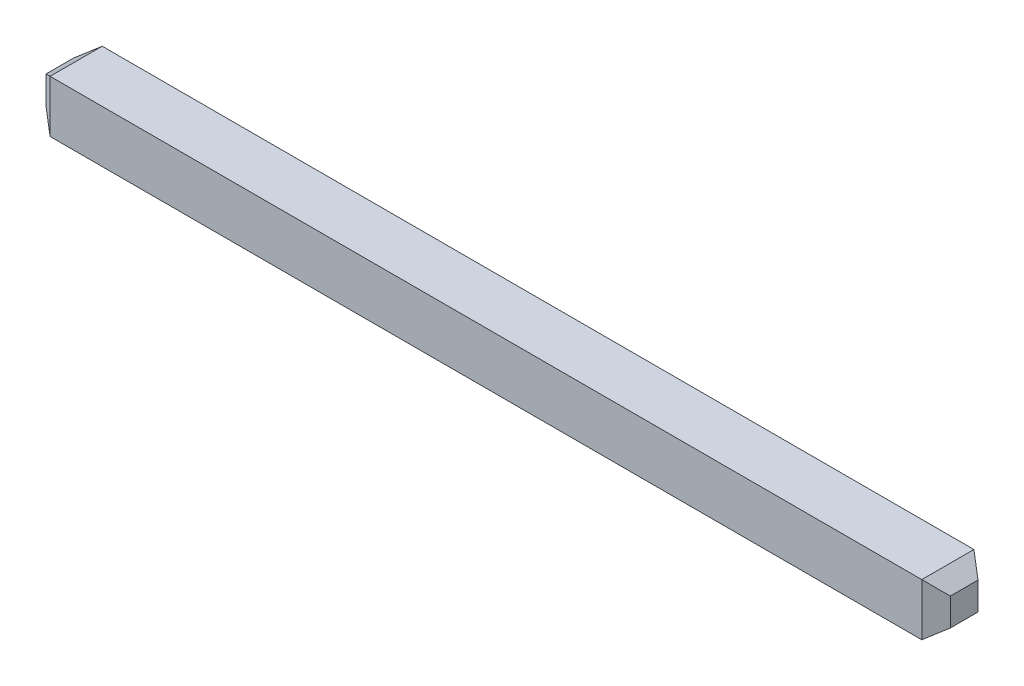
ISO-10303-21;
HEADER;
FILE_DESCRIPTION(('STEP AP214'),'2;1');
FILE_NAME('part.step','',(''),(''),'','','');
FILE_SCHEMA(('AUTOMOTIVE_DESIGN { 1 0 10303 214 1 1 1 1 }'));
ENDSEC;
DATA;
#1=APPLICATION_CONTEXT('core data for automotive mechanical design processes');
#2=APPLICATION_PROTOCOL_DEFINITION('international standard','automotive_design',2000,#1);
#3=PRODUCT_CONTEXT('',#1,'mechanical');
#4=PRODUCT('Part','Part','',(#3));
#5=PRODUCT_RELATED_PRODUCT_CATEGORY('part','',(#4));
#6=PRODUCT_DEFINITION_FORMATION('','',#4);
#7=PRODUCT_DEFINITION_CONTEXT('part definition',#1,'design');
#8=PRODUCT_DEFINITION('design','',#6,#7);
#9=PRODUCT_DEFINITION_SHAPE('','',#8);
#10=(LENGTH_UNIT() NAMED_UNIT(*) SI_UNIT(.MILLI.,.METRE.));
#11=(NAMED_UNIT(*) PLANE_ANGLE_UNIT() SI_UNIT($,.RADIAN.));
#12=(NAMED_UNIT(*) SI_UNIT($,.STERADIAN.) SOLID_ANGLE_UNIT());
#13=UNCERTAINTY_MEASURE_WITH_UNIT(LENGTH_MEASURE(1.E-05),#10,'distance_accuracy_value','');
#14=(GEOMETRIC_REPRESENTATION_CONTEXT(3) GLOBAL_UNCERTAINTY_ASSIGNED_CONTEXT((#13)) GLOBAL_UNIT_ASSIGNED_CONTEXT((#10,
#11,#12)) REPRESENTATION_CONTEXT('',''));
#15=CARTESIAN_POINT('',(0.,0.,0.));
#16=DIRECTION('',(0.,0.,1.));
#17=DIRECTION('',(1.,0.,0.));
#18=AXIS2_PLACEMENT_3D('',#15,#16,#17);
#19=CARTESIAN_POINT('',(-2.4,3.77,-21.835));
#20=DIRECTION('',(0.5999999999908,0.,0.8000000000069));
#21=DIRECTION('',(0.8000000000069,0.,-0.5999999999908));
#22=AXIS2_PLACEMENT_3D('',#19,#20,#21);
#23=PLANE('',#22);
#24=DIRECTION('',(0.,1.,0.));
#25=VECTOR('',#24,1.);
#26=CARTESIAN_POINT('',(-2.3,3.77,-21.91));
#27=LINE('',#26,#25);
#28=CARTESIAN_POINT('',(-2.29999999999957,4.09,-21.9099999999994));
#29=VERTEX_POINT('',#28);
#30=CARTESIAN_POINT('',(-2.29999999999957,3.45,-21.9099999999994));
#31=VERTEX_POINT('',#30);
#32=EDGE_CURVE('E101',#29,#31,#27,.F.);
#33=ORIENTED_EDGE('',*,*,#32,.T.);
#34=DIRECTION('',(-0.685994340570039,0.514495755427529,0.51449575542752));
#35=VECTOR('',#34,1.);
#36=CARTESIAN_POINT('',(-2.3,3.45,-21.91));
#37=LINE('',#36,#35);
#38=CARTESIAN_POINT('',(-2.50000000000022,3.6,-21.7600000000003));
#39=VERTEX_POINT('',#38);
#40=EDGE_CURVE('E85',#31,#39,#37,.T.);
#41=ORIENTED_EDGE('',*,*,#40,.T.);
#42=DIRECTION('',(0.,1.,0.));
#43=VECTOR('',#42,1.);
#44=CARTESIAN_POINT('',(-2.5,3.77,-21.76));
#45=LINE('',#44,#43);
#46=CARTESIAN_POINT('',(-2.50000000000043,3.94,-21.7600000000006));
#47=VERTEX_POINT('',#46);
#48=EDGE_CURVE('E79',#39,#47,#45,.T.);
#49=ORIENTED_EDGE('',*,*,#48,.T.);
#50=DIRECTION('',(-0.685994340570039,-0.514495755427529,0.51449575542752));
#51=VECTOR('',#50,1.);
#52=CARTESIAN_POINT('',(-2.3,4.09,-21.91));
#53=LINE('',#52,#51);
#54=EDGE_CURVE('E20',#29,#47,#53,.T.);
#55=ORIENTED_EDGE('',*,*,#54,.F.);
#56=EDGE_LOOP('',(#33,#41,#49,#55));
#57=FACE_BOUND('',#56,.T.);
#58=ADVANCED_FACE('F17',(#57),#23,.F.);
#59=CARTESIAN_POINT('',(8.5,3.77,-21.835));
#60=DIRECTION('',(-0.5999999999908,0.,0.8000000000069));
#61=DIRECTION('',(0.8000000000069,0.,0.5999999999908));
#62=AXIS2_PLACEMENT_3D('',#59,#60,#61);
#63=PLANE('',#62);
#64=DIRECTION('',(0.,1.,0.));
#65=VECTOR('',#64,1.);
#66=CARTESIAN_POINT('',(8.6,3.77,-21.76));
#67=LINE('',#66,#65);
#68=CARTESIAN_POINT('',(8.60000000000021,3.6,-21.7600000000003));
#69=VERTEX_POINT('',#68);
#70=CARTESIAN_POINT('',(8.60000000000043,3.94,-21.7600000000006));
#71=VERTEX_POINT('',#70);
#72=EDGE_CURVE('E113',#69,#71,#67,.T.);
#73=ORIENTED_EDGE('',*,*,#72,.F.);
#74=DIRECTION('',(-0.685994340570037,-0.514495755427528,-0.514495755427522));
#75=VECTOR('',#74,1.);
#76=CARTESIAN_POINT('',(8.6,3.6,-21.76));
#77=LINE('',#76,#75);
#78=CARTESIAN_POINT('',(8.39999999999957,3.45,-21.9099999999994));
#79=VERTEX_POINT('',#78);
#80=EDGE_CURVE('E108',#69,#79,#77,.T.);
#81=ORIENTED_EDGE('',*,*,#80,.T.);
#82=DIRECTION('',(0.,1.,0.));
#83=VECTOR('',#82,1.);
#84=CARTESIAN_POINT('',(8.4,3.77,-21.91));
#85=LINE('',#84,#83);
#86=CARTESIAN_POINT('',(8.39999999999957,4.09,-21.9099999999994));
#87=VERTEX_POINT('',#86);
#88=EDGE_CURVE('E99',#79,#87,#85,.T.);
#89=ORIENTED_EDGE('',*,*,#88,.T.);
#90=DIRECTION('',(-0.685994340570037,0.514495755427528,-0.514495755427522));
#91=VECTOR('',#90,1.);
#92=CARTESIAN_POINT('',(8.6,3.94,-21.76));
#93=LINE('',#92,#91);
#94=EDGE_CURVE('E116',#71,#87,#93,.T.);
#95=ORIENTED_EDGE('',*,*,#94,.F.);
#96=EDGE_LOOP('',(#73,#81,#89,#95));
#97=FACE_BOUND('',#96,.T.);
#98=ADVANCED_FACE('F214',(#97),#63,.F.);
#99=CARTESIAN_POINT('',(-2.4,4.015,-21.59));
#100=DIRECTION('',(-0.6,0.8,0.));
#101=DIRECTION('',(-0.8,-0.6,0.));
#102=AXIS2_PLACEMENT_3D('',#99,#100,#101);
#103=PLANE('',#102);
#104=DIRECTION('',(-0.685994340575952,-0.514495755427526,-0.514495755419639));
#105=VECTOR('',#104,1.);
#106=CARTESIAN_POINT('',(-2.29999999999914,4.09,-21.2700000000012));
#107=LINE('',#106,#105);
#108=CARTESIAN_POINT('',(-2.29999999999989,4.09,-21.2700000000001));
#109=VERTEX_POINT('',#108);
#110=CARTESIAN_POINT('',(-2.50000000000022,3.94,-21.4199999999997));
#111=VERTEX_POINT('',#110);
#112=EDGE_CURVE('E128',#109,#111,#107,.T.);
#113=ORIENTED_EDGE('',*,*,#112,.F.);
#114=DIRECTION('',(0.,0.,1.));
#115=VECTOR('',#114,1.);
#116=CARTESIAN_POINT('',(-2.3,4.09,-21.59));
#117=LINE('',#116,#115);
#118=EDGE_CURVE('E93',#29,#109,#117,.T.);
#119=ORIENTED_EDGE('',*,*,#118,.F.);
#120=ORIENTED_EDGE('',*,*,#54,.T.);
#121=DIRECTION('',(0.,0.,-1.));
#122=VECTOR('',#121,1.);
#123=CARTESIAN_POINT('',(-2.5,3.94,-21.59));
#124=LINE('',#123,#122);
#125=EDGE_CURVE('E87',#47,#111,#124,.F.);
#126=ORIENTED_EDGE('',*,*,#125,.T.);
#127=EDGE_LOOP('',(#113,#119,#120,#126));
#128=FACE_BOUND('',#127,.T.);
#129=ADVANCED_FACE('F90',(#128),#103,.T.);
#130=CARTESIAN_POINT('',(-2.5,3.77,-21.59));
#131=DIRECTION('',(1.,0.,0.));
#132=DIRECTION('',(0.,0.,-1.));
#133=AXIS2_PLACEMENT_3D('',#130,#131,#132);
#134=PLANE('',#133);
#135=DIRECTION('',(0.,1.,0.));
#136=VECTOR('',#135,1.);
#137=CARTESIAN_POINT('',(-2.50000000000086,3.77,-21.4199999999989));
#138=LINE('',#137,#136);
#139=CARTESIAN_POINT('',(-2.50000000000022,3.6,-21.4199999999997));
#140=VERTEX_POINT('',#139);
#141=EDGE_CURVE('E97',#111,#140,#138,.F.);
#142=ORIENTED_EDGE('',*,*,#141,.F.);
#143=ORIENTED_EDGE('',*,*,#125,.F.);
#144=ORIENTED_EDGE('',*,*,#48,.F.);
#145=DIRECTION('',(0.,0.,1.));
#146=VECTOR('',#145,1.);
#147=CARTESIAN_POINT('',(-2.5,3.6,-21.59));
#148=LINE('',#147,#146);
#149=EDGE_CURVE('E105',#39,#140,#148,.T.);
#150=ORIENTED_EDGE('',*,*,#149,.T.);
#151=EDGE_LOOP('',(#142,#143,#144,#150));
#152=FACE_BOUND('',#151,.T.);
#153=ADVANCED_FACE('F95',(#152),#134,.F.);
#154=CARTESIAN_POINT('',(3.05,3.77,-21.91));
#155=DIRECTION('',(0.,0.,1.));
#156=DIRECTION('',(1.,0.,0.));
#157=AXIS2_PLACEMENT_3D('',#154,#155,#156);
#158=PLANE('',#157);
#159=ORIENTED_EDGE('',*,*,#32,.F.);
#160=DIRECTION('',(1.,0.,0.));
#161=VECTOR('',#160,1.);
#162=CARTESIAN_POINT('',(3.05,4.09,-21.91));
#163=LINE('',#162,#161);
#164=EDGE_CURVE('E122',#87,#29,#163,.F.);
#165=ORIENTED_EDGE('',*,*,#164,.F.);
#166=ORIENTED_EDGE('',*,*,#88,.F.);
#167=DIRECTION('',(1.,0.,0.));
#168=VECTOR('',#167,1.);
#169=CARTESIAN_POINT('',(3.05,3.45,-21.91));
#170=LINE('',#169,#168);
#171=EDGE_CURVE('E136',#79,#31,#170,.F.);
#172=ORIENTED_EDGE('',*,*,#171,.T.);
#173=EDGE_LOOP('',(#159,#165,#166,#172));
#174=FACE_BOUND('',#173,.T.);
#175=ADVANCED_FACE('F182',(#174),#158,.F.);
#176=CARTESIAN_POINT('',(-2.4,3.525,-21.59));
#177=DIRECTION('',(0.6,0.8,0.));
#178=DIRECTION('',(-0.8,0.6,0.));
#179=AXIS2_PLACEMENT_3D('',#176,#177,#178);
#180=PLANE('',#179);
#181=DIRECTION('',(0.,0.,1.));
#182=VECTOR('',#181,1.);
#183=CARTESIAN_POINT('',(-2.3,3.45,-21.59));
#184=LINE('',#183,#182);
#185=CARTESIAN_POINT('',(-2.29999999999978,3.45,-21.2700000000003));
#186=VERTEX_POINT('',#185);
#187=EDGE_CURVE('E139',#31,#186,#184,.T.);
#188=ORIENTED_EDGE('',*,*,#187,.T.);
#189=DIRECTION('',(0.685994340575952,-0.514495755427526,0.514495755419639));
#190=VECTOR('',#189,1.);
#191=CARTESIAN_POINT('',(-2.50000000000086,3.6,-21.4199999999989));
#192=LINE('',#191,#190);
#193=EDGE_CURVE('E131',#140,#186,#192,.T.);
#194=ORIENTED_EDGE('',*,*,#193,.F.);
#195=ORIENTED_EDGE('',*,*,#149,.F.);
#196=ORIENTED_EDGE('',*,*,#40,.F.);
#197=EDGE_LOOP('',(#188,#194,#195,#196));
#198=FACE_BOUND('',#197,.T.);
#199=ADVANCED_FACE('F179',(#198),#180,.F.);
#200=CARTESIAN_POINT('',(8.5,3.525,-21.59));
#201=DIRECTION('',(-0.6,0.8,0.));
#202=DIRECTION('',(-0.8,-0.6,0.));
#203=AXIS2_PLACEMENT_3D('',#200,#201,#202);
#204=PLANE('',#203);
#205=DIRECTION('',(0.,0.,-1.));
#206=VECTOR('',#205,1.);
#207=CARTESIAN_POINT('',(8.6,3.6,-21.59));
#208=LINE('',#207,#206);
#209=CARTESIAN_POINT('',(8.60000000000021,3.6,-21.4199999999997));
#210=VERTEX_POINT('',#209);
#211=EDGE_CURVE('E110',#210,#69,#208,.T.);
#212=ORIENTED_EDGE('',*,*,#211,.F.);
#213=DIRECTION('',(0.685994340575951,0.514495755427526,-0.514495755419639));
#214=VECTOR('',#213,1.);
#215=CARTESIAN_POINT('',(8.39999999999914,3.45,-21.2700000000012));
#216=LINE('',#215,#214);
#217=CARTESIAN_POINT('',(8.39999999999989,3.45,-21.2700000000001));
#218=VERTEX_POINT('',#217);
#219=EDGE_CURVE('E35',#218,#210,#216,.T.);
#220=ORIENTED_EDGE('',*,*,#219,.F.);
#221=DIRECTION('',(0.,0.,1.));
#222=VECTOR('',#221,1.);
#223=CARTESIAN_POINT('',(8.4,3.45,-21.59));
#224=LINE('',#223,#222);
#225=EDGE_CURVE('E134',#218,#79,#224,.F.);
#226=ORIENTED_EDGE('',*,*,#225,.T.);
#227=ORIENTED_EDGE('',*,*,#80,.F.);
#228=EDGE_LOOP('',(#212,#220,#226,#227));
#229=FACE_BOUND('',#228,.T.);
#230=ADVANCED_FACE('F181',(#229),#204,.F.);
#231=CARTESIAN_POINT('',(8.6,3.77,-21.59));
#232=DIRECTION('',(1.,0.,0.));
#233=DIRECTION('',(0.,0.,-1.));
#234=AXIS2_PLACEMENT_3D('',#231,#232,#233);
#235=PLANE('',#234);
#236=ORIENTED_EDGE('',*,*,#72,.T.);
#237=DIRECTION('',(0.,0.,1.));
#238=VECTOR('',#237,1.);
#239=CARTESIAN_POINT('',(8.6,3.94,-21.59));
#240=LINE('',#239,#238);
#241=CARTESIAN_POINT('',(8.60000000000021,3.94,-21.4199999999997));
#242=VERTEX_POINT('',#241);
#243=EDGE_CURVE('E119',#242,#71,#240,.F.);
#244=ORIENTED_EDGE('',*,*,#243,.F.);
#245=DIRECTION('',(0.,1.,0.));
#246=VECTOR('',#245,1.);
#247=CARTESIAN_POINT('',(8.60000000000086,3.77,-21.4199999999989));
#248=LINE('',#247,#246);
#249=EDGE_CURVE('E142',#210,#242,#248,.T.);
#250=ORIENTED_EDGE('',*,*,#249,.F.);
#251=ORIENTED_EDGE('',*,*,#211,.T.);
#252=EDGE_LOOP('',(#236,#244,#250,#251));
#253=FACE_BOUND('',#252,.T.);
#254=ADVANCED_FACE('F189',(#253),#235,.T.);
#255=CARTESIAN_POINT('',(8.5,4.015,-21.59));
#256=DIRECTION('',(0.6,0.8,0.));
#257=DIRECTION('',(-0.8,0.6,0.));
#258=AXIS2_PLACEMENT_3D('',#255,#256,#257);
#259=PLANE('',#258);
#260=DIRECTION('',(-0.685994340575951,0.514495755427526,0.514495755419639));
#261=VECTOR('',#260,1.);
#262=CARTESIAN_POINT('',(8.60000000000086,3.94,-21.4199999999989));
#263=LINE('',#262,#261);
#264=CARTESIAN_POINT('',(8.39999999999989,4.09,-21.2700000000001));
#265=VERTEX_POINT('',#264);
#266=EDGE_CURVE('E145',#242,#265,#263,.T.);
#267=ORIENTED_EDGE('',*,*,#266,.F.);
#268=ORIENTED_EDGE('',*,*,#243,.T.);
#269=ORIENTED_EDGE('',*,*,#94,.T.);
#270=DIRECTION('',(0.,0.,1.));
#271=VECTOR('',#270,1.);
#272=CARTESIAN_POINT('',(8.4,4.09,-21.59));
#273=LINE('',#272,#271);
#274=EDGE_CURVE('E125',#265,#87,#273,.F.);
#275=ORIENTED_EDGE('',*,*,#274,.F.);
#276=EDGE_LOOP('',(#267,#268,#269,#275));
#277=FACE_BOUND('',#276,.T.);
#278=ADVANCED_FACE('F170',(#277),#259,.T.);
#279=CARTESIAN_POINT('',(3.05,4.09,-21.59));
#280=DIRECTION('',(0.,1.,0.));
#281=DIRECTION('',(0.,0.,1.));
#282=AXIS2_PLACEMENT_3D('',#279,#280,#281);
#283=PLANE('',#282);
#284=DIRECTION('',(1.,0.,0.));
#285=VECTOR('',#284,1.);
#286=CARTESIAN_POINT('',(3.05,4.09,-21.27));
#287=LINE('',#286,#285);
#288=EDGE_CURVE('E148',#265,#109,#287,.F.);
#289=ORIENTED_EDGE('',*,*,#288,.F.);
#290=ORIENTED_EDGE('',*,*,#274,.T.);
#291=ORIENTED_EDGE('',*,*,#164,.T.);
#292=ORIENTED_EDGE('',*,*,#118,.T.);
#293=EDGE_LOOP('',(#289,#290,#291,#292));
#294=FACE_BOUND('',#293,.T.);
#295=ADVANCED_FACE('F173',(#294),#283,.T.);
#296=CARTESIAN_POINT('',(-2.4,3.77,-21.345));
#297=DIRECTION('',(-0.5999999999908,0.,0.8000000000069));
#298=DIRECTION('',(0.8000000000069,0.,0.5999999999908));
#299=AXIS2_PLACEMENT_3D('',#296,#297,#298);
#300=PLANE('',#299);
#301=ORIENTED_EDGE('',*,*,#193,.T.);
#302=DIRECTION('',(0.,1.,0.));
#303=VECTOR('',#302,1.);
#304=CARTESIAN_POINT('',(-2.3,3.77,-21.27));
#305=LINE('',#304,#303);
#306=EDGE_CURVE('E151',#109,#186,#305,.F.);
#307=ORIENTED_EDGE('',*,*,#306,.F.);
#308=ORIENTED_EDGE('',*,*,#112,.T.);
#309=ORIENTED_EDGE('',*,*,#141,.T.);
#310=EDGE_LOOP('',(#301,#307,#308,#309));
#311=FACE_BOUND('',#310,.T.);
#312=ADVANCED_FACE('F176',(#311),#300,.T.);
#313=CARTESIAN_POINT('',(3.05,3.45,-21.59));
#314=DIRECTION('',(0.,1.,0.));
#315=DIRECTION('',(0.,0.,1.));
#316=AXIS2_PLACEMENT_3D('',#313,#314,#315);
#317=PLANE('',#316);
#318=ORIENTED_EDGE('',*,*,#187,.F.);
#319=ORIENTED_EDGE('',*,*,#171,.F.);
#320=ORIENTED_EDGE('',*,*,#225,.F.);
#321=DIRECTION('',(1.,0.,0.));
#322=VECTOR('',#321,1.);
#323=CARTESIAN_POINT('',(3.05,3.45,-21.27));
#324=LINE('',#323,#322);
#325=EDGE_CURVE('E26',#186,#218,#324,.T.);
#326=ORIENTED_EDGE('',*,*,#325,.F.);
#327=EDGE_LOOP('',(#318,#319,#320,#326));
#328=FACE_BOUND('',#327,.T.);
#329=ADVANCED_FACE('F162',(#328),#317,.F.);
#330=CARTESIAN_POINT('',(8.5,3.77,-21.345));
#331=DIRECTION('',(0.5999999999908,0.,0.8000000000069));
#332=DIRECTION('',(0.8000000000069,0.,-0.5999999999908));
#333=AXIS2_PLACEMENT_3D('',#330,#331,#332);
#334=PLANE('',#333);
#335=ORIENTED_EDGE('',*,*,#266,.T.);
#336=DIRECTION('',(0.,1.,0.));
#337=VECTOR('',#336,1.);
#338=CARTESIAN_POINT('',(8.4,3.77,-21.27));
#339=LINE('',#338,#337);
#340=EDGE_CURVE('E11',#218,#265,#339,.T.);
#341=ORIENTED_EDGE('',*,*,#340,.F.);
#342=ORIENTED_EDGE('',*,*,#219,.T.);
#343=ORIENTED_EDGE('',*,*,#249,.T.);
#344=EDGE_LOOP('',(#335,#341,#342,#343));
#345=FACE_BOUND('',#344,.T.);
#346=ADVANCED_FACE('F166',(#345),#334,.T.);
#347=CARTESIAN_POINT('',(3.05,3.77,-21.27));
#348=DIRECTION('',(0.,0.,1.));
#349=DIRECTION('',(1.,0.,0.));
#350=AXIS2_PLACEMENT_3D('',#347,#348,#349);
#351=PLANE('',#350);
#352=ORIENTED_EDGE('',*,*,#325,.T.);
#353=ORIENTED_EDGE('',*,*,#340,.T.);
#354=ORIENTED_EDGE('',*,*,#288,.T.);
#355=ORIENTED_EDGE('',*,*,#306,.T.);
#356=EDGE_LOOP('',(#352,#353,#354,#355));
#357=FACE_BOUND('',#356,.T.);
#358=ADVANCED_FACE('F157',(#357),#351,.T.);
#359=CLOSED_SHELL('',(#58,#98,#129,#153,#175,#199,#230,#254,#278,#295,#312,#329,#346,#358));
#360=MANIFOLD_SOLID_BREP('B1',#359);
#361=ADVANCED_BREP_SHAPE_REPRESENTATION('',(#18,#360),#14);
#362=SHAPE_DEFINITION_REPRESENTATION(#9,#361);
ENDSEC;
END-ISO-10303-21;
